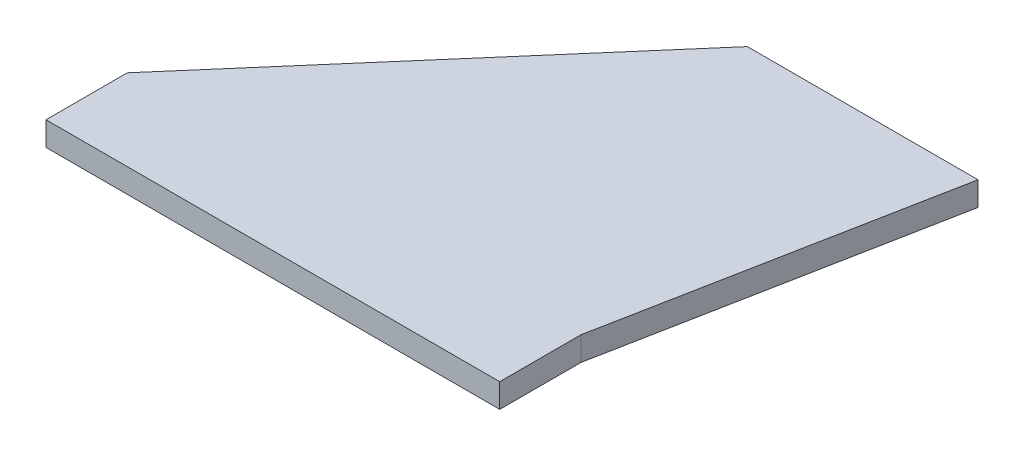
ISO-10303-21;
HEADER;
FILE_DESCRIPTION(('STEP AP214'),'2;1');
FILE_NAME('part.step','',(''),(''),'','','');
FILE_SCHEMA(('AUTOMOTIVE_DESIGN { 1 0 10303 214 1 1 1 1 }'));
ENDSEC;
DATA;
#1=APPLICATION_CONTEXT('core data for automotive mechanical design processes');
#2=APPLICATION_PROTOCOL_DEFINITION('international standard','automotive_design',2000,#1);
#3=PRODUCT_CONTEXT('',#1,'mechanical');
#4=PRODUCT('Part','Part','',(#3));
#5=PRODUCT_RELATED_PRODUCT_CATEGORY('part','',(#4));
#6=PRODUCT_DEFINITION_FORMATION('','',#4);
#7=PRODUCT_DEFINITION_CONTEXT('part definition',#1,'design');
#8=PRODUCT_DEFINITION('design','',#6,#7);
#9=PRODUCT_DEFINITION_SHAPE('','',#8);
#10=(LENGTH_UNIT() NAMED_UNIT(*) SI_UNIT(.MILLI.,.METRE.));
#11=(NAMED_UNIT(*) PLANE_ANGLE_UNIT() SI_UNIT($,.RADIAN.));
#12=(NAMED_UNIT(*) SI_UNIT($,.STERADIAN.) SOLID_ANGLE_UNIT());
#13=UNCERTAINTY_MEASURE_WITH_UNIT(LENGTH_MEASURE(1.E-05),#10,'distance_accuracy_value','');
#14=(GEOMETRIC_REPRESENTATION_CONTEXT(3) GLOBAL_UNCERTAINTY_ASSIGNED_CONTEXT((#13)) GLOBAL_UNIT_ASSIGNED_CONTEXT((#10,
#11,#12)) REPRESENTATION_CONTEXT('',''));
#15=CARTESIAN_POINT('',(0.,0.,0.));
#16=DIRECTION('',(0.,0.,1.));
#17=DIRECTION('',(1.,0.,0.));
#18=AXIS2_PLACEMENT_3D('',#15,#16,#17);
#19=CARTESIAN_POINT('',(-44.,6.35,-88.));
#20=DIRECTION('',(0.75682300776916,0.,0.653619870346092));
#21=DIRECTION('',(0.653619870346092,0.,-0.75682300776916));
#22=AXIS2_PLACEMENT_3D('',#19,#20,#21);
#23=PLANE('',#22);
#24=DIRECTION('',(-0.653619870346092,0.,0.75682300776916));
#25=VECTOR('',#24,1.);
#26=CARTESIAN_POINT('',(-44.,0.,-88.));
#27=LINE('',#26,#25);
#28=CARTESIAN_POINT('',(-44.,0.,-88.));
#29=VERTEX_POINT('',#28);
#30=CARTESIAN_POINT('',(-120.,0.,0.));
#31=VERTEX_POINT('',#30);
#32=EDGE_CURVE('E118',#29,#31,#27,.T.);
#33=ORIENTED_EDGE('',*,*,#32,.T.);
#34=DIRECTION('',(0.,-1.,0.));
#35=VECTOR('',#34,1.);
#36=CARTESIAN_POINT('',(-120.,6.35,0.));
#37=LINE('',#36,#35);
#38=CARTESIAN_POINT('',(-120.,6.35,0.));
#39=VERTEX_POINT('',#38);
#40=EDGE_CURVE('E11',#39,#31,#37,.T.);
#41=ORIENTED_EDGE('',*,*,#40,.F.);
#42=DIRECTION('',(-0.653619870346092,0.,0.75682300776916));
#43=VECTOR('',#42,1.);
#44=CARTESIAN_POINT('',(-44.,6.35,-88.));
#45=LINE('',#44,#43);
#46=CARTESIAN_POINT('',(-44.,6.35,-88.));
#47=VERTEX_POINT('',#46);
#48=EDGE_CURVE('E84',#47,#39,#45,.T.);
#49=ORIENTED_EDGE('',*,*,#48,.F.);
#50=DIRECTION('',(0.,-1.,0.));
#51=VECTOR('',#50,1.);
#52=CARTESIAN_POINT('',(-44.,6.35,-88.));
#53=LINE('',#52,#51);
#54=EDGE_CURVE('E138',#47,#29,#53,.T.);
#55=ORIENTED_EDGE('',*,*,#54,.T.);
#56=EDGE_LOOP('',(#33,#41,#49,#55));
#57=FACE_BOUND('',#56,.T.);
#58=ADVANCED_FACE('F43',(#57),#23,.F.);
#59=CARTESIAN_POINT('',(0.,6.35,0.));
#60=DIRECTION('',(-0.981846934843066,0.,-0.189674976049229));
#61=DIRECTION('',(-0.189674976049229,0.,0.981846934843067));
#62=AXIS2_PLACEMENT_3D('',#59,#60,#61);
#63=PLANE('',#62);
#64=DIRECTION('',(0.189674976049229,0.,-0.981846934843066));
#65=VECTOR('',#64,1.);
#66=CARTESIAN_POINT('',(0.,0.,0.));
#67=LINE('',#66,#65);
#68=CARTESIAN_POINT('',(0.,0.,0.));
#69=VERTEX_POINT('',#68);
#70=CARTESIAN_POINT('',(17.,0.,-88.));
#71=VERTEX_POINT('',#70);
#72=EDGE_CURVE('E73',#69,#71,#67,.T.);
#73=ORIENTED_EDGE('',*,*,#72,.T.);
#74=DIRECTION('',(0.,-1.,0.));
#75=VECTOR('',#74,1.);
#76=CARTESIAN_POINT('',(17.,6.35,-88.));
#77=LINE('',#76,#75);
#78=CARTESIAN_POINT('',(17.,6.35,-88.));
#79=VERTEX_POINT('',#78);
#80=EDGE_CURVE('E143',#79,#71,#77,.T.);
#81=ORIENTED_EDGE('',*,*,#80,.F.);
#82=DIRECTION('',(0.189674976049229,0.,-0.981846934843066));
#83=VECTOR('',#82,1.);
#84=CARTESIAN_POINT('',(0.,6.35,0.));
#85=LINE('',#84,#83);
#86=CARTESIAN_POINT('',(0.,6.35,0.));
#87=VERTEX_POINT('',#86);
#88=EDGE_CURVE('E135',#87,#79,#85,.T.);
#89=ORIENTED_EDGE('',*,*,#88,.F.);
#90=DIRECTION('',(0.,-1.,0.));
#91=VECTOR('',#90,1.);
#92=CARTESIAN_POINT('',(0.,6.35,0.));
#93=LINE('',#92,#91);
#94=EDGE_CURVE('E51',#87,#69,#93,.T.);
#95=ORIENTED_EDGE('',*,*,#94,.T.);
#96=EDGE_LOOP('',(#73,#81,#89,#95));
#97=FACE_BOUND('',#96,.T.);
#98=ADVANCED_FACE('F145',(#97),#63,.F.);
#99=CARTESIAN_POINT('',(17.,6.35,-88.));
#100=DIRECTION('',(0.,0.,1.));
#101=DIRECTION('',(1.,0.,0.));
#102=AXIS2_PLACEMENT_3D('',#99,#100,#101);
#103=PLANE('',#102);
#104=DIRECTION('',(-1.,0.,0.));
#105=VECTOR('',#104,1.);
#106=CARTESIAN_POINT('',(17.,0.,-88.));
#107=LINE('',#106,#105);
#108=EDGE_CURVE('E79',#71,#29,#107,.T.);
#109=ORIENTED_EDGE('',*,*,#108,.T.);
#110=ORIENTED_EDGE('',*,*,#54,.F.);
#111=DIRECTION('',(-1.,0.,0.));
#112=VECTOR('',#111,1.);
#113=CARTESIAN_POINT('',(17.,6.35,-88.));
#114=LINE('',#113,#112);
#115=EDGE_CURVE('E59',#79,#47,#114,.T.);
#116=ORIENTED_EDGE('',*,*,#115,.F.);
#117=ORIENTED_EDGE('',*,*,#80,.T.);
#118=EDGE_LOOP('',(#109,#110,#116,#117));
#119=FACE_BOUND('',#118,.T.);
#120=ADVANCED_FACE('F152',(#119),#103,.F.);
#121=CARTESIAN_POINT('',(0.,6.35,0.));
#122=DIRECTION('',(0.,1.,0.));
#123=DIRECTION('',(0.,0.,1.));
#124=AXIS2_PLACEMENT_3D('',#121,#122,#123);
#125=PLANE('',#124);
#126=ORIENTED_EDGE('',*,*,#48,.T.);
#127=DIRECTION('',(0.,0.,1.));
#128=VECTOR('',#127,1.);
#129=CARTESIAN_POINT('',(-120.,6.35,0.));
#130=LINE('',#129,#128);
#131=CARTESIAN_POINT('',(-120.,6.35,21.5));
#132=VERTEX_POINT('',#131);
#133=EDGE_CURVE('E101',#39,#132,#130,.T.);
#134=ORIENTED_EDGE('',*,*,#133,.T.);
#135=DIRECTION('',(1.,0.,0.));
#136=VECTOR('',#135,1.);
#137=CARTESIAN_POINT('',(-120.,6.35,21.5));
#138=LINE('',#137,#136);
#139=CARTESIAN_POINT('',(0.,6.35,21.5));
#140=VERTEX_POINT('',#139);
#141=EDGE_CURVE('E106',#132,#140,#138,.T.);
#142=ORIENTED_EDGE('',*,*,#141,.T.);
#143=DIRECTION('',(0.,0.,-1.));
#144=VECTOR('',#143,1.);
#145=CARTESIAN_POINT('',(0.,6.35,21.5));
#146=LINE('',#145,#144);
#147=EDGE_CURVE('E124',#140,#87,#146,.T.);
#148=ORIENTED_EDGE('',*,*,#147,.T.);
#149=ORIENTED_EDGE('',*,*,#88,.T.);
#150=ORIENTED_EDGE('',*,*,#115,.T.);
#151=EDGE_LOOP('',(#126,#134,#142,#148,#149,#150));
#152=FACE_BOUND('',#151,.T.);
#153=ADVANCED_FACE('F103',(#152),#125,.T.);
#154=CARTESIAN_POINT('',(0.,0.,0.));
#155=DIRECTION('',(0.,1.,0.));
#156=DIRECTION('',(0.,0.,1.));
#157=AXIS2_PLACEMENT_3D('',#154,#155,#156);
#158=PLANE('',#157);
#159=ORIENTED_EDGE('',*,*,#32,.F.);
#160=ORIENTED_EDGE('',*,*,#108,.F.);
#161=ORIENTED_EDGE('',*,*,#72,.F.);
#162=DIRECTION('',(0.,0.,-1.));
#163=VECTOR('',#162,1.);
#164=CARTESIAN_POINT('',(0.,0.,21.5));
#165=LINE('',#164,#163);
#166=CARTESIAN_POINT('',(0.,0.,21.5));
#167=VERTEX_POINT('',#166);
#168=EDGE_CURVE('E109',#167,#69,#165,.T.);
#169=ORIENTED_EDGE('',*,*,#168,.F.);
#170=DIRECTION('',(1.,0.,0.));
#171=VECTOR('',#170,1.);
#172=CARTESIAN_POINT('',(-120.,0.,21.5));
#173=LINE('',#172,#171);
#174=CARTESIAN_POINT('',(-120.,0.,21.5));
#175=VERTEX_POINT('',#174);
#176=EDGE_CURVE('E129',#175,#167,#173,.T.);
#177=ORIENTED_EDGE('',*,*,#176,.F.);
#178=DIRECTION('',(0.,0.,1.));
#179=VECTOR('',#178,1.);
#180=CARTESIAN_POINT('',(-120.,0.,0.));
#181=LINE('',#180,#179);
#182=EDGE_CURVE('E115',#31,#175,#181,.T.);
#183=ORIENTED_EDGE('',*,*,#182,.F.);
#184=EDGE_LOOP('',(#159,#160,#161,#169,#177,#183));
#185=FACE_BOUND('',#184,.T.);
#186=ADVANCED_FACE('F150',(#185),#158,.F.);
#187=CARTESIAN_POINT('',(-120.,6.35,0.));
#188=DIRECTION('',(1.,0.,0.));
#189=DIRECTION('',(0.,0.,-1.));
#190=AXIS2_PLACEMENT_3D('',#187,#188,#189);
#191=PLANE('',#190);
#192=ORIENTED_EDGE('',*,*,#182,.T.);
#193=DIRECTION('',(0.,-1.,0.));
#194=VECTOR('',#193,1.);
#195=CARTESIAN_POINT('',(-120.,6.35,21.5));
#196=LINE('',#195,#194);
#197=EDGE_CURVE('E112',#132,#175,#196,.T.);
#198=ORIENTED_EDGE('',*,*,#197,.F.);
#199=ORIENTED_EDGE('',*,*,#133,.F.);
#200=ORIENTED_EDGE('',*,*,#40,.T.);
#201=EDGE_LOOP('',(#192,#198,#199,#200));
#202=FACE_BOUND('',#201,.T.);
#203=ADVANCED_FACE('F113',(#202),#191,.F.);
#204=CARTESIAN_POINT('',(-120.,6.35,21.5));
#205=DIRECTION('',(0.,0.,-1.));
#206=DIRECTION('',(-1.,0.,0.));
#207=AXIS2_PLACEMENT_3D('',#204,#205,#206);
#208=PLANE('',#207);
#209=ORIENTED_EDGE('',*,*,#176,.T.);
#210=DIRECTION('',(0.,-1.,0.));
#211=VECTOR('',#210,1.);
#212=CARTESIAN_POINT('',(0.,6.35,21.5));
#213=LINE('',#212,#211);
#214=EDGE_CURVE('E119',#140,#167,#213,.T.);
#215=ORIENTED_EDGE('',*,*,#214,.F.);
#216=ORIENTED_EDGE('',*,*,#141,.F.);
#217=ORIENTED_EDGE('',*,*,#197,.T.);
#218=EDGE_LOOP('',(#209,#215,#216,#217));
#219=FACE_BOUND('',#218,.T.);
#220=ADVANCED_FACE('F121',(#219),#208,.F.);
#221=CARTESIAN_POINT('',(0.,6.35,21.5));
#222=DIRECTION('',(-1.,0.,0.));
#223=DIRECTION('',(0.,0.,1.));
#224=AXIS2_PLACEMENT_3D('',#221,#222,#223);
#225=PLANE('',#224);
#226=ORIENTED_EDGE('',*,*,#168,.T.);
#227=ORIENTED_EDGE('',*,*,#94,.F.);
#228=ORIENTED_EDGE('',*,*,#147,.F.);
#229=ORIENTED_EDGE('',*,*,#214,.T.);
#230=EDGE_LOOP('',(#226,#227,#228,#229));
#231=FACE_BOUND('',#230,.T.);
#232=ADVANCED_FACE('F151',(#231),#225,.F.);
#233=CLOSED_SHELL('',(#58,#98,#120,#153,#186,#203,#220,#232));
#234=MANIFOLD_SOLID_BREP('B2',#233);
#235=ADVANCED_BREP_SHAPE_REPRESENTATION('',(#18,#234),#14);
#236=SHAPE_DEFINITION_REPRESENTATION(#9,#235);
ENDSEC;
END-ISO-10303-21;
